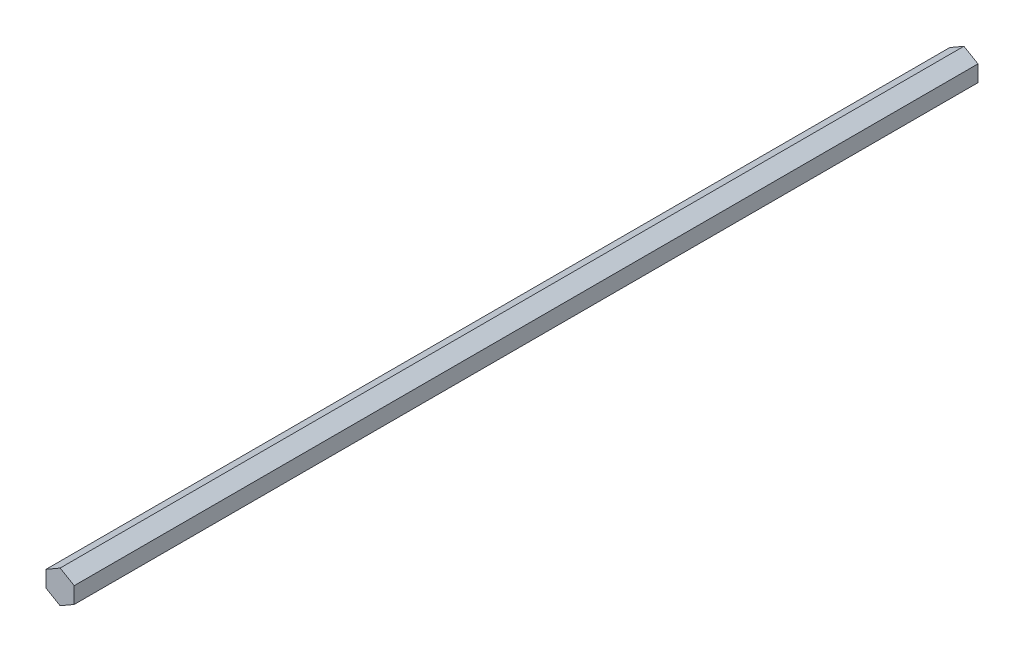
ISO-10303-21;
HEADER;
FILE_DESCRIPTION(('STEP AP214'),'2;1');
FILE_NAME('part.step','',(''),(''),'','','');
FILE_SCHEMA(('AUTOMOTIVE_DESIGN { 1 0 10303 214 1 1 1 1 }'));
ENDSEC;
DATA;
#1=APPLICATION_CONTEXT('core data for automotive mechanical design processes');
#2=APPLICATION_PROTOCOL_DEFINITION('international standard','automotive_design',2000,#1);
#3=PRODUCT_CONTEXT('',#1,'mechanical');
#4=PRODUCT('Part','Part','',(#3));
#5=PRODUCT_RELATED_PRODUCT_CATEGORY('part','',(#4));
#6=PRODUCT_DEFINITION_FORMATION('','',#4);
#7=PRODUCT_DEFINITION_CONTEXT('part definition',#1,'design');
#8=PRODUCT_DEFINITION('design','',#6,#7);
#9=PRODUCT_DEFINITION_SHAPE('','',#8);
#10=(LENGTH_UNIT() NAMED_UNIT(*) SI_UNIT(.MILLI.,.METRE.));
#11=(NAMED_UNIT(*) PLANE_ANGLE_UNIT() SI_UNIT($,.RADIAN.));
#12=(NAMED_UNIT(*) SI_UNIT($,.STERADIAN.) SOLID_ANGLE_UNIT());
#13=UNCERTAINTY_MEASURE_WITH_UNIT(LENGTH_MEASURE(1.E-05),#10,'distance_accuracy_value','');
#14=(GEOMETRIC_REPRESENTATION_CONTEXT(3) GLOBAL_UNCERTAINTY_ASSIGNED_CONTEXT((#13)) GLOBAL_UNIT_ASSIGNED_CONTEXT((#10,
#11,#12)) REPRESENTATION_CONTEXT('',''));
#15=CARTESIAN_POINT('',(0.,0.,0.));
#16=DIRECTION('',(0.,0.,1.));
#17=DIRECTION('',(1.,0.,0.));
#18=AXIS2_PLACEMENT_3D('',#15,#16,#17);
#19=CARTESIAN_POINT('',(-6.35,-3.66617420935412,203.2));
#20=DIRECTION('',(0.5,0.866025403784439,0.));
#21=DIRECTION('',(-0.866025403784439,0.5,0.));
#22=AXIS2_PLACEMENT_3D('',#19,#20,#21);
#23=PLANE('',#22);
#24=DIRECTION('',(0.866025403784439,-0.5,0.));
#25=VECTOR('',#24,1.);
#26=CARTESIAN_POINT('',(-6.35,-3.66617420935412,-203.2));
#27=LINE('',#26,#25);
#28=CARTESIAN_POINT('',(-6.35,-3.66617420935412,-203.2));
#29=VERTEX_POINT('',#28);
#30=CARTESIAN_POINT('',(0.,-7.33234841870825,-203.2));
#31=VERTEX_POINT('',#30);
#32=EDGE_CURVE('E117',#29,#31,#27,.T.);
#33=ORIENTED_EDGE('',*,*,#32,.T.);
#34=DIRECTION('',(0.,0.,-1.));
#35=VECTOR('',#34,1.);
#36=CARTESIAN_POINT('',(0.,-7.33234841870825,203.2));
#37=LINE('',#36,#35);
#38=CARTESIAN_POINT('',(0.,-7.33234841870825,203.2));
#39=VERTEX_POINT('',#38);
#40=EDGE_CURVE('E11',#39,#31,#37,.T.);
#41=ORIENTED_EDGE('',*,*,#40,.F.);
#42=DIRECTION('',(0.866025403784439,-0.5,0.));
#43=VECTOR('',#42,1.);
#44=CARTESIAN_POINT('',(-6.35,-3.66617420935412,203.2));
#45=LINE('',#44,#43);
#46=CARTESIAN_POINT('',(-6.35,-3.66617420935412,203.2));
#47=VERTEX_POINT('',#46);
#48=EDGE_CURVE('E127',#47,#39,#45,.T.);
#49=ORIENTED_EDGE('',*,*,#48,.F.);
#50=DIRECTION('',(0.,0.,-1.));
#51=VECTOR('',#50,1.);
#52=CARTESIAN_POINT('',(-6.35,-3.66617420935412,203.2));
#53=LINE('',#52,#51);
#54=EDGE_CURVE('E113',#47,#29,#53,.T.);
#55=ORIENTED_EDGE('',*,*,#54,.T.);
#56=EDGE_LOOP('',(#33,#41,#49,#55));
#57=FACE_BOUND('',#56,.T.);
#58=ADVANCED_FACE('F33',(#57),#23,.F.);
#59=CARTESIAN_POINT('',(0.,-7.33234841870825,203.2));
#60=DIRECTION('',(-0.5,0.866025403784438,0.));
#61=DIRECTION('',(-0.866025403784438,-0.500000000000001,0.));
#62=AXIS2_PLACEMENT_3D('',#59,#60,#61);
#63=PLANE('',#62);
#64=DIRECTION('',(0.866025403784438,0.5,0.));
#65=VECTOR('',#64,1.);
#66=CARTESIAN_POINT('',(0.,-7.33234841870825,-203.2));
#67=LINE('',#66,#65);
#68=CARTESIAN_POINT('',(6.35,-3.66617420935412,-203.2));
#69=VERTEX_POINT('',#68);
#70=EDGE_CURVE('E120',#31,#69,#67,.T.);
#71=ORIENTED_EDGE('',*,*,#70,.T.);
#72=DIRECTION('',(0.,0.,-1.));
#73=VECTOR('',#72,1.);
#74=CARTESIAN_POINT('',(6.35,-3.66617420935412,203.2));
#75=LINE('',#74,#73);
#76=CARTESIAN_POINT('',(6.35,-3.66617420935412,203.2));
#77=VERTEX_POINT('',#76);
#78=EDGE_CURVE('E41',#77,#69,#75,.T.);
#79=ORIENTED_EDGE('',*,*,#78,.F.);
#80=DIRECTION('',(0.866025403784438,0.5,0.));
#81=VECTOR('',#80,1.);
#82=CARTESIAN_POINT('',(0.,-7.33234841870825,203.2));
#83=LINE('',#82,#81);
#84=EDGE_CURVE('E86',#39,#77,#83,.T.);
#85=ORIENTED_EDGE('',*,*,#84,.F.);
#86=ORIENTED_EDGE('',*,*,#40,.T.);
#87=EDGE_LOOP('',(#71,#79,#85,#86));
#88=FACE_BOUND('',#87,.T.);
#89=ADVANCED_FACE('F151',(#88),#63,.F.);
#90=CARTESIAN_POINT('',(6.35,-3.66617420935412,203.2));
#91=DIRECTION('',(-1.,0.,0.));
#92=DIRECTION('',(0.,-1.,0.));
#93=AXIS2_PLACEMENT_3D('',#90,#91,#92);
#94=PLANE('',#93);
#95=DIRECTION('',(0.,1.,0.));
#96=VECTOR('',#95,1.);
#97=CARTESIAN_POINT('',(6.35,-3.66617420935412,-203.2));
#98=LINE('',#97,#96);
#99=CARTESIAN_POINT('',(6.35,3.66617420935413,-203.2));
#100=VERTEX_POINT('',#99);
#101=EDGE_CURVE('E122',#69,#100,#98,.T.);
#102=ORIENTED_EDGE('',*,*,#101,.T.);
#103=DIRECTION('',(0.,0.,-1.));
#104=VECTOR('',#103,1.);
#105=CARTESIAN_POINT('',(6.35,3.66617420935413,203.2));
#106=LINE('',#105,#104);
#107=CARTESIAN_POINT('',(6.35,3.66617420935413,203.2));
#108=VERTEX_POINT('',#107);
#109=EDGE_CURVE('E108',#108,#100,#106,.T.);
#110=ORIENTED_EDGE('',*,*,#109,.F.);
#111=DIRECTION('',(0.,1.,0.));
#112=VECTOR('',#111,1.);
#113=CARTESIAN_POINT('',(6.35,-3.66617420935412,203.2));
#114=LINE('',#113,#112);
#115=EDGE_CURVE('E99',#77,#108,#114,.T.);
#116=ORIENTED_EDGE('',*,*,#115,.F.);
#117=ORIENTED_EDGE('',*,*,#78,.T.);
#118=EDGE_LOOP('',(#102,#110,#116,#117));
#119=FACE_BOUND('',#118,.T.);
#120=ADVANCED_FACE('F133',(#119),#94,.F.);
#121=CARTESIAN_POINT('',(6.35,3.66617420935413,203.2));
#122=DIRECTION('',(-0.5,-0.866025403784439,0.));
#123=DIRECTION('',(0.866025403784439,-0.5,0.));
#124=AXIS2_PLACEMENT_3D('',#121,#122,#123);
#125=PLANE('',#124);
#126=DIRECTION('',(-0.866025403784439,0.5,0.));
#127=VECTOR('',#126,1.);
#128=CARTESIAN_POINT('',(6.35,3.66617420935413,-203.2));
#129=LINE('',#128,#127);
#130=CARTESIAN_POINT('',(0.,7.33234841870825,-203.2));
#131=VERTEX_POINT('',#130);
#132=EDGE_CURVE('E107',#100,#131,#129,.T.);
#133=ORIENTED_EDGE('',*,*,#132,.T.);
#134=DIRECTION('',(0.,0.,-1.));
#135=VECTOR('',#134,1.);
#136=CARTESIAN_POINT('',(0.,7.33234841870825,203.2));
#137=LINE('',#136,#135);
#138=CARTESIAN_POINT('',(0.,7.33234841870825,203.2));
#139=VERTEX_POINT('',#138);
#140=EDGE_CURVE('E104',#139,#131,#137,.T.);
#141=ORIENTED_EDGE('',*,*,#140,.F.);
#142=DIRECTION('',(-0.866025403784439,0.5,0.));
#143=VECTOR('',#142,1.);
#144=CARTESIAN_POINT('',(6.35,3.66617420935413,203.2));
#145=LINE('',#144,#143);
#146=EDGE_CURVE('E93',#108,#139,#145,.T.);
#147=ORIENTED_EDGE('',*,*,#146,.F.);
#148=ORIENTED_EDGE('',*,*,#109,.T.);
#149=EDGE_LOOP('',(#133,#141,#147,#148));
#150=FACE_BOUND('',#149,.T.);
#151=ADVANCED_FACE('F105',(#150),#125,.F.);
#152=CARTESIAN_POINT('',(0.,7.33234841870825,203.2));
#153=DIRECTION('',(0.5,-0.866025403784438,0.));
#154=DIRECTION('',(0.866025403784439,0.5,0.));
#155=AXIS2_PLACEMENT_3D('',#152,#153,#154);
#156=PLANE('',#155);
#157=DIRECTION('',(-0.866025403784438,-0.5,0.));
#158=VECTOR('',#157,1.);
#159=CARTESIAN_POINT('',(0.,7.33234841870825,-203.2));
#160=LINE('',#159,#158);
#161=CARTESIAN_POINT('',(-6.35,3.66617420935412,-203.2));
#162=VERTEX_POINT('',#161);
#163=EDGE_CURVE('E72',#131,#162,#160,.T.);
#164=ORIENTED_EDGE('',*,*,#163,.T.);
#165=DIRECTION('',(0.,0.,-1.));
#166=VECTOR('',#165,1.);
#167=CARTESIAN_POINT('',(-6.35,3.66617420935412,203.2));
#168=LINE('',#167,#166);
#169=CARTESIAN_POINT('',(-6.35,3.66617420935412,203.2));
#170=VERTEX_POINT('',#169);
#171=EDGE_CURVE('E109',#170,#162,#168,.T.);
#172=ORIENTED_EDGE('',*,*,#171,.F.);
#173=DIRECTION('',(-0.866025403784438,-0.5,0.));
#174=VECTOR('',#173,1.);
#175=CARTESIAN_POINT('',(0.,7.33234841870825,203.2));
#176=LINE('',#175,#174);
#177=EDGE_CURVE('E97',#139,#170,#176,.T.);
#178=ORIENTED_EDGE('',*,*,#177,.F.);
#179=ORIENTED_EDGE('',*,*,#140,.T.);
#180=EDGE_LOOP('',(#164,#172,#178,#179));
#181=FACE_BOUND('',#180,.T.);
#182=ADVANCED_FACE('F111',(#181),#156,.F.);
#183=CARTESIAN_POINT('',(-6.35,3.66617420935412,203.2));
#184=DIRECTION('',(1.,0.,0.));
#185=DIRECTION('',(0.,1.,0.));
#186=AXIS2_PLACEMENT_3D('',#183,#184,#185);
#187=PLANE('',#186);
#188=DIRECTION('',(0.,-1.,0.));
#189=VECTOR('',#188,1.);
#190=CARTESIAN_POINT('',(-6.35,3.66617420935412,-203.2));
#191=LINE('',#190,#189);
#192=EDGE_CURVE('E78',#162,#29,#191,.T.);
#193=ORIENTED_EDGE('',*,*,#192,.T.);
#194=ORIENTED_EDGE('',*,*,#54,.F.);
#195=DIRECTION('',(0.,-1.,0.));
#196=VECTOR('',#195,1.);
#197=CARTESIAN_POINT('',(-6.35,3.66617420935412,203.2));
#198=LINE('',#197,#196);
#199=EDGE_CURVE('E49',#170,#47,#198,.T.);
#200=ORIENTED_EDGE('',*,*,#199,.F.);
#201=ORIENTED_EDGE('',*,*,#171,.T.);
#202=EDGE_LOOP('',(#193,#194,#200,#201));
#203=FACE_BOUND('',#202,.T.);
#204=ADVANCED_FACE('F140',(#203),#187,.F.);
#205=CARTESIAN_POINT('',(0.,0.,203.2));
#206=DIRECTION('',(0.,0.,1.));
#207=DIRECTION('',(1.,0.,0.));
#208=AXIS2_PLACEMENT_3D('',#205,#206,#207);
#209=PLANE('',#208);
#210=ORIENTED_EDGE('',*,*,#48,.T.);
#211=ORIENTED_EDGE('',*,*,#84,.T.);
#212=ORIENTED_EDGE('',*,*,#115,.T.);
#213=ORIENTED_EDGE('',*,*,#146,.T.);
#214=ORIENTED_EDGE('',*,*,#177,.T.);
#215=ORIENTED_EDGE('',*,*,#199,.T.);
#216=EDGE_LOOP('',(#210,#211,#212,#213,#214,#215));
#217=FACE_BOUND('',#216,.T.);
#218=ADVANCED_FACE('F95',(#217),#209,.T.);
#219=CARTESIAN_POINT('',(0.,0.,-203.2));
#220=DIRECTION('',(0.,0.,1.));
#221=DIRECTION('',(1.,0.,0.));
#222=AXIS2_PLACEMENT_3D('',#219,#220,#221);
#223=PLANE('',#222);
#224=ORIENTED_EDGE('',*,*,#32,.F.);
#225=ORIENTED_EDGE('',*,*,#192,.F.);
#226=ORIENTED_EDGE('',*,*,#163,.F.);
#227=ORIENTED_EDGE('',*,*,#132,.F.);
#228=ORIENTED_EDGE('',*,*,#101,.F.);
#229=ORIENTED_EDGE('',*,*,#70,.F.);
#230=EDGE_LOOP('',(#224,#225,#226,#227,#228,#229));
#231=FACE_BOUND('',#230,.T.);
#232=ADVANCED_FACE('F136',(#231),#223,.F.);
#233=CLOSED_SHELL('',(#58,#89,#120,#151,#182,#204,#218,#232));
#234=MANIFOLD_SOLID_BREP('B2',#233);
#235=ADVANCED_BREP_SHAPE_REPRESENTATION('',(#18,#234),#14);
#236=SHAPE_DEFINITION_REPRESENTATION(#9,#235);
ENDSEC;
END-ISO-10303-21;
